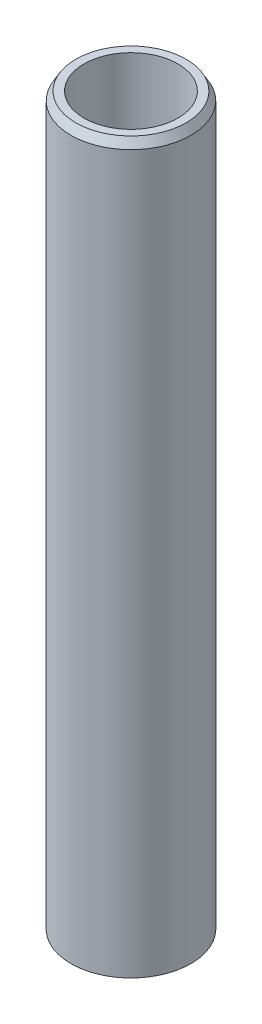
ISO-10303-21;
HEADER;
FILE_DESCRIPTION(('STEP AP214'),'2;1');
FILE_NAME('part.step','',(''),(''),'','','');
FILE_SCHEMA(('AUTOMOTIVE_DESIGN { 1 0 10303 214 1 1 1 1 }'));
ENDSEC;
DATA;
#1=APPLICATION_CONTEXT('core data for automotive mechanical design processes');
#2=APPLICATION_PROTOCOL_DEFINITION('international standard','automotive_design',2000,#1);
#3=PRODUCT_CONTEXT('',#1,'mechanical');
#4=PRODUCT('Part','Part','',(#3));
#5=PRODUCT_RELATED_PRODUCT_CATEGORY('part','',(#4));
#6=PRODUCT_DEFINITION_FORMATION('','',#4);
#7=PRODUCT_DEFINITION_CONTEXT('part definition',#1,'design');
#8=PRODUCT_DEFINITION('design','',#6,#7);
#9=PRODUCT_DEFINITION_SHAPE('','',#8);
#10=(LENGTH_UNIT() NAMED_UNIT(*) SI_UNIT(.MILLI.,.METRE.));
#11=(NAMED_UNIT(*) PLANE_ANGLE_UNIT() SI_UNIT($,.RADIAN.));
#12=(NAMED_UNIT(*) SI_UNIT($,.STERADIAN.) SOLID_ANGLE_UNIT());
#13=UNCERTAINTY_MEASURE_WITH_UNIT(LENGTH_MEASURE(1.E-05),#10,'distance_accuracy_value','');
#14=(GEOMETRIC_REPRESENTATION_CONTEXT(3) GLOBAL_UNCERTAINTY_ASSIGNED_CONTEXT((#13)) GLOBAL_UNIT_ASSIGNED_CONTEXT((#10,
#11,#12)) REPRESENTATION_CONTEXT('',''));
#15=CARTESIAN_POINT('',(0.,0.,0.));
#16=DIRECTION('',(0.,0.,1.));
#17=DIRECTION('',(1.,0.,0.));
#18=AXIS2_PLACEMENT_3D('',#15,#16,#17);
#19=CARTESIAN_POINT('',(0.,304.508595336446,0.));
#20=DIRECTION('',(0.,-1.,0.));
#21=DIRECTION('',(0.,0.,-1.));
#22=AXIS2_PLACEMENT_3D('',#19,#20,#21);
#23=CYLINDRICAL_SURFACE('',#22,25.);
#24=CARTESIAN_POINT('',(0.,300.998719747058,0.));
#25=DIRECTION('',(0.,1.,0.));
#26=DIRECTION('',(0.,0.,1.));
#27=AXIS2_PLACEMENT_3D('',#24,#25,#26);
#28=CIRCLE('',#27,25.);
#29=CARTESIAN_POINT('',(0.,300.998719747058,25.));
#30=VERTEX_POINT('',#29);
#31=EDGE_CURVE('E50',#30,#30,#28,.F.);
#32=ORIENTED_EDGE('',*,*,#31,.T.);
#33=EDGE_LOOP('',(#32));
#34=FACE_BOUND('',#33,.T.);
#35=CARTESIAN_POINT('',(0.,2.02642761635535,0.));
#36=DIRECTION('',(0.,1.,0.));
#37=DIRECTION('',(0.,0.,1.));
#38=AXIS2_PLACEMENT_3D('',#35,#36,#37);
#39=CIRCLE('',#38,25.);
#40=CARTESIAN_POINT('',(0.,2.02642761635535,25.));
#41=VERTEX_POINT('',#40);
#42=EDGE_CURVE('E51',#41,#41,#39,.T.);
#43=ORIENTED_EDGE('',*,*,#42,.T.);
#44=EDGE_LOOP('',(#43));
#45=FACE_BOUND('',#44,.T.);
#46=ADVANCED_FACE('F39',(#34,#45),#23,.T.);
#47=CARTESIAN_POINT('',(0.,304.508595336446,0.));
#48=DIRECTION('',(0.,1.,0.));
#49=DIRECTION('',(0.,0.,1.));
#50=AXIS2_PLACEMENT_3D('',#47,#48,#49);
#51=PLANE('',#50);
#52=CARTESIAN_POINT('',(0.,304.508595336446,0.));
#53=DIRECTION('',(0.,1.,0.));
#54=DIRECTION('',(0.,0.,1.));
#55=AXIS2_PLACEMENT_3D('',#52,#53,#54);
#56=CIRCLE('',#55,22.9735723836446);
#57=CARTESIAN_POINT('',(0.,304.508595336446,22.9735723836446));
#58=VERTEX_POINT('',#57);
#59=EDGE_CURVE('E54',#58,#58,#56,.T.);
#60=ORIENTED_EDGE('',*,*,#59,.T.);
#61=EDGE_LOOP('',(#60));
#62=FACE_BOUND('',#61,.T.);
#63=CARTESIAN_POINT('',(0.,304.508595336446,0.));
#64=DIRECTION('',(0.,1.,0.));
#65=DIRECTION('',(0.,0.,1.));
#66=AXIS2_PLACEMENT_3D('',#63,#64,#65);
#67=CIRCLE('',#66,19.5837467449945);
#68=CARTESIAN_POINT('',(0.,304.508595336446,19.5837467449945));
#69=VERTEX_POINT('',#68);
#70=EDGE_CURVE('E58',#69,#69,#67,.T.);
#71=ORIENTED_EDGE('',*,*,#70,.F.);
#72=EDGE_LOOP('',(#71));
#73=FACE_BOUND('',#72,.T.);
#74=ADVANCED_FACE('F69',(#62,#73),#51,.T.);
#75=CARTESIAN_POINT('',(0.,0.,0.));
#76=DIRECTION('',(0.,1.,0.));
#77=DIRECTION('',(0.,0.,1.));
#78=AXIS2_PLACEMENT_3D('',#75,#76,#77);
#79=PLANE('',#78);
#80=CARTESIAN_POINT('',(0.,0.,0.));
#81=DIRECTION('',(0.,1.,0.));
#82=DIRECTION('',(0.,0.,1.));
#83=AXIS2_PLACEMENT_3D('',#80,#81,#82);
#84=CIRCLE('',#83,21.4901244106118);
#85=CARTESIAN_POINT('',(0.,0.,21.4901244106118));
#86=VERTEX_POINT('',#85);
#87=EDGE_CURVE('E10',#86,#86,#84,.F.);
#88=ORIENTED_EDGE('',*,*,#87,.T.);
#89=EDGE_LOOP('',(#88));
#90=FACE_BOUND('',#89,.T.);
#91=CARTESIAN_POINT('',(0.,0.,0.));
#92=DIRECTION('',(0.,1.,0.));
#93=DIRECTION('',(0.,0.,1.));
#94=AXIS2_PLACEMENT_3D('',#91,#92,#93);
#95=CIRCLE('',#94,19.5837467449945);
#96=CARTESIAN_POINT('',(0.,0.,19.5837467449945));
#97=VERTEX_POINT('',#96);
#98=EDGE_CURVE('E63',#97,#97,#95,.T.);
#99=ORIENTED_EDGE('',*,*,#98,.T.);
#100=EDGE_LOOP('',(#99));
#101=FACE_BOUND('',#100,.T.);
#102=ADVANCED_FACE('F75',(#90,#101),#79,.F.);
#103=CARTESIAN_POINT('',(0.,304.508595336446,0.));
#104=DIRECTION('',(0.,-1.,0.));
#105=DIRECTION('',(0.,0.,-1.));
#106=AXIS2_PLACEMENT_3D('',#103,#104,#105);
#107=CYLINDRICAL_SURFACE('',#106,19.5837467449945);
#108=ORIENTED_EDGE('',*,*,#70,.T.);
#109=EDGE_LOOP('',(#108));
#110=FACE_BOUND('',#109,.T.);
#111=ORIENTED_EDGE('',*,*,#98,.F.);
#112=EDGE_LOOP('',(#111));
#113=FACE_BOUND('',#112,.T.);
#114=ADVANCED_FACE('F70',(#110,#113),#107,.F.);
#115=CARTESIAN_POINT('',(0.,304.508595336446,0.));
#116=DIRECTION('',(0.,-1.,0.));
#117=DIRECTION('',(0.,0.,-1.));
#118=AXIS2_PLACEMENT_3D('',#115,#116,#117);
#119=CONICAL_SURFACE('',#118,22.9735723836446,0.523598775598301);
#120=ORIENTED_EDGE('',*,*,#31,.F.);
#121=EDGE_LOOP('',(#120));
#122=FACE_BOUND('',#121,.T.);
#123=ORIENTED_EDGE('',*,*,#59,.F.);
#124=EDGE_LOOP('',(#123));
#125=FACE_BOUND('',#124,.T.);
#126=ADVANCED_FACE('F81',(#122,#125),#119,.T.);
#127=CARTESIAN_POINT('',(0.,2.02642761635535,0.));
#128=DIRECTION('',(0.,1.,0.));
#129=DIRECTION('',(0.,0.,1.));
#130=AXIS2_PLACEMENT_3D('',#127,#128,#129);
#131=CONICAL_SURFACE('',#130,25.,1.04719755119661);
#132=ORIENTED_EDGE('',*,*,#87,.F.);
#133=EDGE_LOOP('',(#132));
#134=FACE_BOUND('',#133,.T.);
#135=ORIENTED_EDGE('',*,*,#42,.F.);
#136=EDGE_LOOP('',(#135));
#137=FACE_BOUND('',#136,.T.);
#138=ADVANCED_FACE('F45',(#134,#137),#131,.T.);
#139=CLOSED_SHELL('',(#46,#74,#102,#114,#126,#138));
#140=MANIFOLD_SOLID_BREP('B2',#139);
#141=ADVANCED_BREP_SHAPE_REPRESENTATION('',(#18,#140),#14);
#142=SHAPE_DEFINITION_REPRESENTATION(#9,#141);
ENDSEC;
END-ISO-10303-21;
